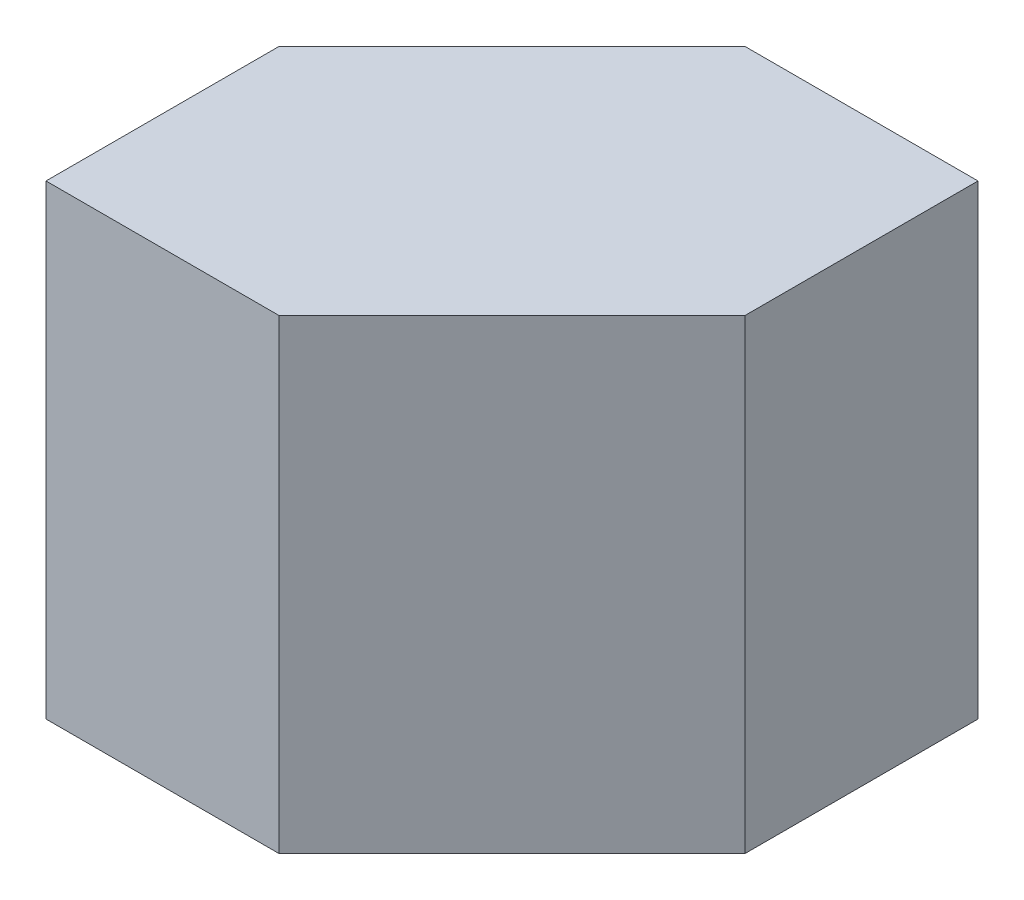
ISO-10303-21;
HEADER;
FILE_DESCRIPTION(('STEP AP214'),'2;1');
FILE_NAME('part.step','',(''),(''),'','','');
FILE_SCHEMA(('AUTOMOTIVE_DESIGN { 1 0 10303 214 1 1 1 1 }'));
ENDSEC;
DATA;
#1=APPLICATION_CONTEXT('core data for automotive mechanical design processes');
#2=APPLICATION_PROTOCOL_DEFINITION('international standard','automotive_design',2000,#1);
#3=PRODUCT_CONTEXT('',#1,'mechanical');
#4=PRODUCT('Part','Part','',(#3));
#5=PRODUCT_RELATED_PRODUCT_CATEGORY('part','',(#4));
#6=PRODUCT_DEFINITION_FORMATION('','',#4);
#7=PRODUCT_DEFINITION_CONTEXT('part definition',#1,'design');
#8=PRODUCT_DEFINITION('design','',#6,#7);
#9=PRODUCT_DEFINITION_SHAPE('','',#8);
#10=(LENGTH_UNIT() NAMED_UNIT(*) SI_UNIT(.MILLI.,.METRE.));
#11=(NAMED_UNIT(*) PLANE_ANGLE_UNIT() SI_UNIT($,.RADIAN.));
#12=(NAMED_UNIT(*) SI_UNIT($,.STERADIAN.) SOLID_ANGLE_UNIT());
#13=UNCERTAINTY_MEASURE_WITH_UNIT(LENGTH_MEASURE(1.E-05),#10,'distance_accuracy_value','');
#14=(GEOMETRIC_REPRESENTATION_CONTEXT(3) GLOBAL_UNCERTAINTY_ASSIGNED_CONTEXT((#13)) GLOBAL_UNIT_ASSIGNED_CONTEXT((#10,
#11,#12)) REPRESENTATION_CONTEXT('',''));
#15=CARTESIAN_POINT('',(0.,0.,0.));
#16=DIRECTION('',(0.,0.,1.));
#17=DIRECTION('',(1.,0.,0.));
#18=AXIS2_PLACEMENT_3D('',#15,#16,#17);
#19=CARTESIAN_POINT('',(0.,0.,20.));
#20=DIRECTION('',(1.,0.,0.));
#21=DIRECTION('',(0.,0.,-1.));
#22=AXIS2_PLACEMENT_3D('',#19,#20,#21);
#23=PLANE('',#22);
#24=DIRECTION('',(0.,0.,-1.));
#25=VECTOR('',#24,1.);
#26=CARTESIAN_POINT('',(0.,20.,20.));
#27=LINE('',#26,#25);
#28=CARTESIAN_POINT('',(0.,20.,20.));
#29=VERTEX_POINT('',#28);
#30=CARTESIAN_POINT('',(0.,20.,10.));
#31=VERTEX_POINT('',#30);
#32=EDGE_CURVE('E96',#29,#31,#27,.T.);
#33=ORIENTED_EDGE('',*,*,#32,.T.);
#34=DIRECTION('',(0.,1.,0.));
#35=VECTOR('',#34,1.);
#36=CARTESIAN_POINT('',(0.,0.,10.));
#37=LINE('',#36,#35);
#38=CARTESIAN_POINT('',(0.,0.,10.));
#39=VERTEX_POINT('',#38);
#40=EDGE_CURVE('E86',#39,#31,#37,.T.);
#41=ORIENTED_EDGE('',*,*,#40,.F.);
#42=DIRECTION('',(0.,0.,-1.));
#43=VECTOR('',#42,1.);
#44=CARTESIAN_POINT('',(0.,0.,20.));
#45=LINE('',#44,#43);
#46=CARTESIAN_POINT('',(0.,0.,20.));
#47=VERTEX_POINT('',#46);
#48=EDGE_CURVE('E11',#47,#39,#45,.T.);
#49=ORIENTED_EDGE('',*,*,#48,.F.);
#50=DIRECTION('',(0.,-1.,0.));
#51=VECTOR('',#50,1.);
#52=CARTESIAN_POINT('',(0.,0.,20.));
#53=LINE('',#52,#51);
#54=EDGE_CURVE('E107',#29,#47,#53,.T.);
#55=ORIENTED_EDGE('',*,*,#54,.F.);
#56=EDGE_LOOP('',(#33,#41,#49,#55));
#57=FACE_BOUND('',#56,.T.);
#58=ADVANCED_FACE('F33',(#57),#23,.F.);
#59=CARTESIAN_POINT('',(0.,0.,20.));
#60=DIRECTION('',(0.,1.,0.));
#61=DIRECTION('',(0.,0.,1.));
#62=AXIS2_PLACEMENT_3D('',#59,#60,#61);
#63=PLANE('',#62);
#64=ORIENTED_EDGE('',*,*,#48,.T.);
#65=DIRECTION('',(0.707106781186548,0.,-0.707106781186548));
#66=VECTOR('',#65,1.);
#67=CARTESIAN_POINT('',(10.,0.,0.));
#68=LINE('',#67,#66);
#69=CARTESIAN_POINT('',(10.,0.,0.));
#70=VERTEX_POINT('',#69);
#71=EDGE_CURVE('E83',#39,#70,#68,.T.);
#72=ORIENTED_EDGE('',*,*,#71,.T.);
#73=DIRECTION('',(1.,0.,0.));
#74=VECTOR('',#73,1.);
#75=CARTESIAN_POINT('',(0.,0.,0.));
#76=LINE('',#75,#74);
#77=CARTESIAN_POINT('',(20.,0.,0.));
#78=VERTEX_POINT('',#77);
#79=EDGE_CURVE('E121',#70,#78,#76,.T.);
#80=ORIENTED_EDGE('',*,*,#79,.T.);
#81=DIRECTION('',(0.,0.,-1.));
#82=VECTOR('',#81,1.);
#83=CARTESIAN_POINT('',(20.,0.,20.));
#84=LINE('',#83,#82);
#85=CARTESIAN_POINT('',(20.,0.,10.));
#86=VERTEX_POINT('',#85);
#87=EDGE_CURVE('E40',#86,#78,#84,.T.);
#88=ORIENTED_EDGE('',*,*,#87,.F.);
#89=DIRECTION('',(-0.707106781186548,0.,0.707106781186548));
#90=VECTOR('',#89,1.);
#91=CARTESIAN_POINT('',(20.,0.,10.));
#92=LINE('',#91,#90);
#93=CARTESIAN_POINT('',(10.,0.,20.));
#94=VERTEX_POINT('',#93);
#95=EDGE_CURVE('E104',#86,#94,#92,.T.);
#96=ORIENTED_EDGE('',*,*,#95,.T.);
#97=DIRECTION('',(1.,0.,0.));
#98=VECTOR('',#97,1.);
#99=CARTESIAN_POINT('',(0.,0.,20.));
#100=LINE('',#99,#98);
#101=EDGE_CURVE('E101',#47,#94,#100,.T.);
#102=ORIENTED_EDGE('',*,*,#101,.F.);
#103=EDGE_LOOP('',(#64,#72,#80,#88,#96,#102));
#104=FACE_BOUND('',#103,.T.);
#105=ADVANCED_FACE('F98',(#104),#63,.F.);
#106=CARTESIAN_POINT('',(20.,0.,20.));
#107=DIRECTION('',(-1.,0.,0.));
#108=DIRECTION('',(0.,0.,1.));
#109=AXIS2_PLACEMENT_3D('',#106,#107,#108);
#110=PLANE('',#109);
#111=DIRECTION('',(0.,0.,-1.));
#112=VECTOR('',#111,1.);
#113=CARTESIAN_POINT('',(20.,20.,20.));
#114=LINE('',#113,#112);
#115=CARTESIAN_POINT('',(20.,20.,10.));
#116=VERTEX_POINT('',#115);
#117=CARTESIAN_POINT('',(20.,20.,0.));
#118=VERTEX_POINT('',#117);
#119=EDGE_CURVE('E127',#116,#118,#114,.T.);
#120=ORIENTED_EDGE('',*,*,#119,.F.);
#121=DIRECTION('',(0.,1.,0.));
#122=VECTOR('',#121,1.);
#123=CARTESIAN_POINT('',(20.,0.,10.));
#124=LINE('',#123,#122);
#125=EDGE_CURVE('E117',#86,#116,#124,.T.);
#126=ORIENTED_EDGE('',*,*,#125,.F.);
#127=ORIENTED_EDGE('',*,*,#87,.T.);
#128=DIRECTION('',(0.,1.,0.));
#129=VECTOR('',#128,1.);
#130=CARTESIAN_POINT('',(20.,0.,0.));
#131=LINE('',#130,#129);
#132=EDGE_CURVE('E114',#78,#118,#131,.T.);
#133=ORIENTED_EDGE('',*,*,#132,.T.);
#134=EDGE_LOOP('',(#120,#126,#127,#133));
#135=FACE_BOUND('',#134,.T.);
#136=ADVANCED_FACE('F133',(#135),#110,.F.);
#137=CARTESIAN_POINT('',(0.,20.,20.));
#138=DIRECTION('',(0.,-1.,0.));
#139=DIRECTION('',(0.,0.,-1.));
#140=AXIS2_PLACEMENT_3D('',#137,#138,#139);
#141=PLANE('',#140);
#142=DIRECTION('',(-1.,0.,0.));
#143=VECTOR('',#142,1.);
#144=CARTESIAN_POINT('',(0.,20.,0.));
#145=LINE('',#144,#143);
#146=CARTESIAN_POINT('',(10.,20.,0.));
#147=VERTEX_POINT('',#146);
#148=EDGE_CURVE('E111',#118,#147,#145,.T.);
#149=ORIENTED_EDGE('',*,*,#148,.T.);
#150=DIRECTION('',(0.707106781186548,0.,-0.707106781186548));
#151=VECTOR('',#150,1.);
#152=CARTESIAN_POINT('',(10.,20.,0.));
#153=LINE('',#152,#151);
#154=EDGE_CURVE('E47',#31,#147,#153,.T.);
#155=ORIENTED_EDGE('',*,*,#154,.F.);
#156=ORIENTED_EDGE('',*,*,#32,.F.);
#157=DIRECTION('',(-1.,0.,0.));
#158=VECTOR('',#157,1.);
#159=CARTESIAN_POINT('',(0.,20.,20.));
#160=LINE('',#159,#158);
#161=CARTESIAN_POINT('',(10.,20.,20.));
#162=VERTEX_POINT('',#161);
#163=EDGE_CURVE('E106',#162,#29,#160,.T.);
#164=ORIENTED_EDGE('',*,*,#163,.F.);
#165=DIRECTION('',(-0.707106781186548,0.,0.707106781186548));
#166=VECTOR('',#165,1.);
#167=CARTESIAN_POINT('',(20.,20.,10.));
#168=LINE('',#167,#166);
#169=EDGE_CURVE('E55',#116,#162,#168,.T.);
#170=ORIENTED_EDGE('',*,*,#169,.F.);
#171=ORIENTED_EDGE('',*,*,#119,.T.);
#172=EDGE_LOOP('',(#149,#155,#156,#164,#170,#171));
#173=FACE_BOUND('',#172,.T.);
#174=ADVANCED_FACE('F138',(#173),#141,.F.);
#175=CARTESIAN_POINT('',(0.,0.,20.));
#176=DIRECTION('',(0.,0.,-1.));
#177=DIRECTION('',(-1.,0.,0.));
#178=AXIS2_PLACEMENT_3D('',#175,#176,#177);
#179=PLANE('',#178);
#180=ORIENTED_EDGE('',*,*,#101,.T.);
#181=DIRECTION('',(0.,1.,0.));
#182=VECTOR('',#181,1.);
#183=CARTESIAN_POINT('',(10.,0.,20.));
#184=LINE('',#183,#182);
#185=EDGE_CURVE('E123',#94,#162,#184,.T.);
#186=ORIENTED_EDGE('',*,*,#185,.T.);
#187=ORIENTED_EDGE('',*,*,#163,.T.);
#188=ORIENTED_EDGE('',*,*,#54,.T.);
#189=EDGE_LOOP('',(#180,#186,#187,#188));
#190=FACE_BOUND('',#189,.T.);
#191=ADVANCED_FACE('F109',(#190),#179,.F.);
#192=CARTESIAN_POINT('',(0.,0.,0.));
#193=DIRECTION('',(0.,0.,-1.));
#194=DIRECTION('',(-1.,0.,0.));
#195=AXIS2_PLACEMENT_3D('',#192,#193,#194);
#196=PLANE('',#195);
#197=DIRECTION('',(0.,1.,0.));
#198=VECTOR('',#197,1.);
#199=CARTESIAN_POINT('',(10.,0.,0.));
#200=LINE('',#199,#198);
#201=EDGE_CURVE('E87',#70,#147,#200,.T.);
#202=ORIENTED_EDGE('',*,*,#201,.T.);
#203=ORIENTED_EDGE('',*,*,#148,.F.);
#204=ORIENTED_EDGE('',*,*,#132,.F.);
#205=ORIENTED_EDGE('',*,*,#79,.F.);
#206=EDGE_LOOP('',(#202,#203,#204,#205));
#207=FACE_BOUND('',#206,.T.);
#208=ADVANCED_FACE('F136',(#207),#196,.T.);
#209=CARTESIAN_POINT('',(20.,0.,10.));
#210=DIRECTION('',(-0.707106781186548,0.,-0.707106781186548));
#211=DIRECTION('',(-0.707106781186548,0.,0.707106781186548));
#212=AXIS2_PLACEMENT_3D('',#209,#210,#211);
#213=PLANE('',#212);
#214=ORIENTED_EDGE('',*,*,#169,.T.);
#215=ORIENTED_EDGE('',*,*,#185,.F.);
#216=ORIENTED_EDGE('',*,*,#95,.F.);
#217=ORIENTED_EDGE('',*,*,#125,.T.);
#218=EDGE_LOOP('',(#214,#215,#216,#217));
#219=FACE_BOUND('',#218,.T.);
#220=ADVANCED_FACE('F142',(#219),#213,.F.);
#221=CARTESIAN_POINT('',(10.,0.,0.));
#222=DIRECTION('',(0.707106781186548,0.,0.707106781186548));
#223=DIRECTION('',(0.707106781186548,0.,-0.707106781186548));
#224=AXIS2_PLACEMENT_3D('',#221,#222,#223);
#225=PLANE('',#224);
#226=ORIENTED_EDGE('',*,*,#154,.T.);
#227=ORIENTED_EDGE('',*,*,#201,.F.);
#228=ORIENTED_EDGE('',*,*,#71,.F.);
#229=ORIENTED_EDGE('',*,*,#40,.T.);
#230=EDGE_LOOP('',(#226,#227,#228,#229));
#231=FACE_BOUND('',#230,.T.);
#232=ADVANCED_FACE('F85',(#231),#225,.F.);
#233=CLOSED_SHELL('',(#58,#105,#136,#174,#191,#208,#220,#232));
#234=MANIFOLD_SOLID_BREP('B2',#233);
#235=ADVANCED_BREP_SHAPE_REPRESENTATION('',(#18,#234),#14);
#236=SHAPE_DEFINITION_REPRESENTATION(#9,#235);
ENDSEC;
END-ISO-10303-21;
